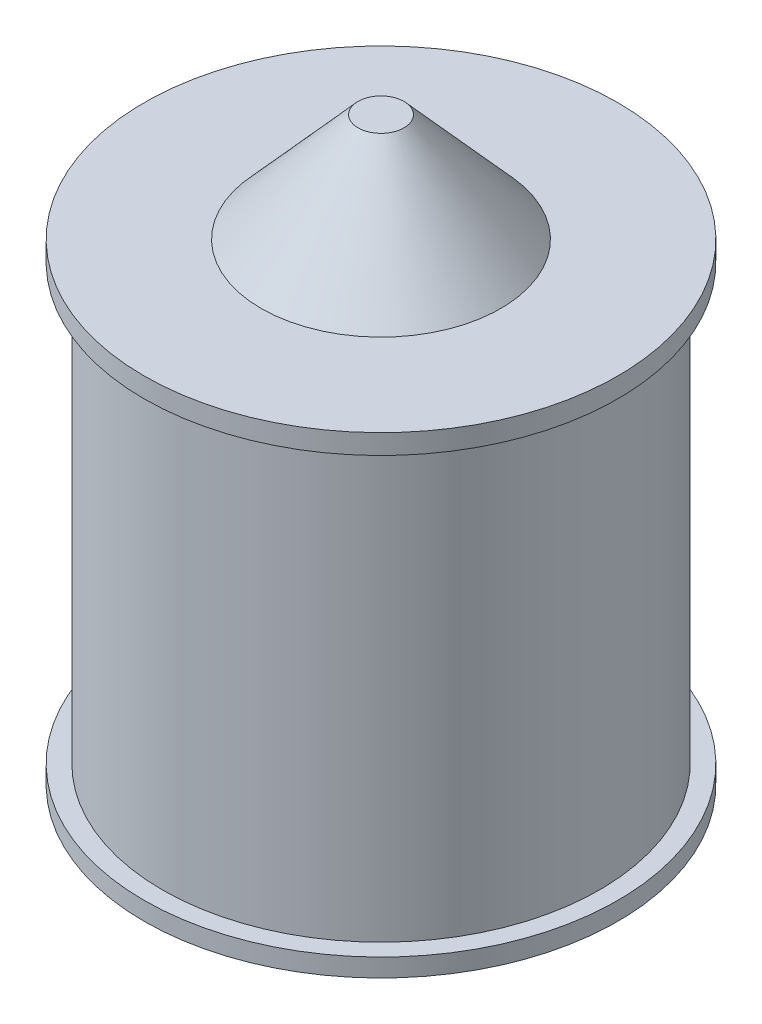
ISO-10303-21;
HEADER;
FILE_DESCRIPTION(('STEP AP214'),'2;1');
FILE_NAME('part.step','',(''),(''),'','','');
FILE_SCHEMA(('AUTOMOTIVE_DESIGN { 1 0 10303 214 1 1 1 1 }'));
ENDSEC;
DATA;
#1=APPLICATION_CONTEXT('core data for automotive mechanical design processes');
#2=APPLICATION_PROTOCOL_DEFINITION('international standard','automotive_design',2000,#1);
#3=PRODUCT_CONTEXT('',#1,'mechanical');
#4=PRODUCT('Part','Part','',(#3));
#5=PRODUCT_RELATED_PRODUCT_CATEGORY('part','',(#4));
#6=PRODUCT_DEFINITION_FORMATION('','',#4);
#7=PRODUCT_DEFINITION_CONTEXT('part definition',#1,'design');
#8=PRODUCT_DEFINITION('design','',#6,#7);
#9=PRODUCT_DEFINITION_SHAPE('','',#8);
#10=(LENGTH_UNIT() NAMED_UNIT(*) SI_UNIT(.MILLI.,.METRE.));
#11=(NAMED_UNIT(*) PLANE_ANGLE_UNIT() SI_UNIT($,.RADIAN.));
#12=(NAMED_UNIT(*) SI_UNIT($,.STERADIAN.) SOLID_ANGLE_UNIT());
#13=UNCERTAINTY_MEASURE_WITH_UNIT(LENGTH_MEASURE(1.E-05),#10,'distance_accuracy_value','');
#14=(GEOMETRIC_REPRESENTATION_CONTEXT(3) GLOBAL_UNCERTAINTY_ASSIGNED_CONTEXT((#13)) GLOBAL_UNIT_ASSIGNED_CONTEXT((#10,
#11,#12)) REPRESENTATION_CONTEXT('',''));
#15=CARTESIAN_POINT('',(0.,0.,0.));
#16=DIRECTION('',(0.,0.,1.));
#17=DIRECTION('',(1.,0.,0.));
#18=AXIS2_PLACEMENT_3D('',#15,#16,#17);
#19=CARTESIAN_POINT('',(50.8214618660544,38.8006335245978,0.));
#20=DIRECTION('',(0.,-1.,0.));
#21=DIRECTION('',(0.,0.,-1.));
#22=AXIS2_PLACEMENT_3D('',#19,#20,#21);
#23=PLANE('',#22);
#24=CARTESIAN_POINT('',(0.,38.8006335245978,0.));
#25=DIRECTION('',(0.,1.,0.));
#26=DIRECTION('',(0.,0.,1.));
#27=AXIS2_PLACEMENT_3D('',#24,#25,#26);
#28=CIRCLE('',#27,50.8214618660544);
#29=CARTESIAN_POINT('',(0.,38.8006335245978,50.8214618660544));
#30=VERTEX_POINT('',#29);
#31=EDGE_CURVE('E117',#30,#30,#28,.T.);
#32=ORIENTED_EDGE('',*,*,#31,.T.);
#33=EDGE_LOOP('',(#32));
#34=FACE_BOUND('',#33,.T.);
#35=CARTESIAN_POINT('',(0.,38.8006335245978,0.));
#36=DIRECTION('',(0.,1.,0.));
#37=DIRECTION('',(0.,0.,1.));
#38=AXIS2_PLACEMENT_3D('',#35,#36,#37);
#39=CIRCLE('',#38,25.7229108897417);
#40=CARTESIAN_POINT('',(0.,38.8006335245978,25.7229108897417));
#41=VERTEX_POINT('',#40);
#42=EDGE_CURVE('E106',#41,#41,#39,.T.);
#43=ORIENTED_EDGE('',*,*,#42,.F.);
#44=EDGE_LOOP('',(#43));
#45=FACE_BOUND('',#44,.T.);
#46=ADVANCED_FACE('F33',(#34,#45),#23,.F.);
#47=CARTESIAN_POINT('',(0.,-62.5731282252533,0.));
#48=DIRECTION('',(0.,1.,0.));
#49=DIRECTION('',(0.,0.,1.));
#50=AXIS2_PLACEMENT_3D('',#47,#48,#49);
#51=PLANE('',#50);
#52=CARTESIAN_POINT('',(0.,-62.5731282252533,0.));
#53=DIRECTION('',(0.,1.,0.));
#54=DIRECTION('',(0.,0.,1.));
#55=AXIS2_PLACEMENT_3D('',#52,#53,#54);
#56=CIRCLE('',#55,50.8214618660544);
#57=CARTESIAN_POINT('',(0.,-62.5731282252533,50.8214618660544));
#58=VERTEX_POINT('',#57);
#59=EDGE_CURVE('E151',#58,#58,#56,.T.);
#60=ORIENTED_EDGE('',*,*,#59,.F.);
#61=EDGE_LOOP('',(#60));
#62=FACE_BOUND('',#61,.T.);
#63=ADVANCED_FACE('F186',(#62),#51,.F.);
#64=CARTESIAN_POINT('',(0.,38.8006335245978,0.));
#65=DIRECTION('',(0.,1.,0.));
#66=DIRECTION('',(0.,0.,1.));
#67=AXIS2_PLACEMENT_3D('',#64,#65,#66);
#68=CYLINDRICAL_SURFACE('',#67,50.8214618660544);
#69=CARTESIAN_POINT('',(0.,-58.6741373887206,0.));
#70=DIRECTION('',(0.,1.,0.));
#71=DIRECTION('',(0.,0.,1.));
#72=AXIS2_PLACEMENT_3D('',#69,#70,#71);
#73=CIRCLE('',#72,50.8214618660544);
#74=CARTESIAN_POINT('',(0.,-58.6741373887206,50.8214618660544));
#75=VERTEX_POINT('',#74);
#76=EDGE_CURVE('E148',#75,#75,#73,.T.);
#77=ORIENTED_EDGE('',*,*,#76,.F.);
#78=EDGE_LOOP('',(#77));
#79=FACE_BOUND('',#78,.T.);
#80=ORIENTED_EDGE('',*,*,#59,.T.);
#81=EDGE_LOOP('',(#80));
#82=FACE_BOUND('',#81,.T.);
#83=ADVANCED_FACE('F192',(#79,#82),#68,.T.);
#84=CARTESIAN_POINT('',(50.8214618660544,-58.6741373887206,0.));
#85=DIRECTION('',(0.,-1.,0.));
#86=DIRECTION('',(0.,0.,-1.));
#87=AXIS2_PLACEMENT_3D('',#84,#85,#86);
#88=PLANE('',#87);
#89=CARTESIAN_POINT('',(0.,-58.6741373887206,0.));
#90=DIRECTION('',(0.,1.,0.));
#91=DIRECTION('',(0.,0.,1.));
#92=AXIS2_PLACEMENT_3D('',#89,#90,#91);
#93=CIRCLE('',#92,46.9224710295217);
#94=CARTESIAN_POINT('',(0.,-58.6741373887206,46.9224710295217));
#95=VERTEX_POINT('',#94);
#96=EDGE_CURVE('E145',#95,#95,#93,.T.);
#97=ORIENTED_EDGE('',*,*,#96,.F.);
#98=EDGE_LOOP('',(#97));
#99=FACE_BOUND('',#98,.T.);
#100=ORIENTED_EDGE('',*,*,#76,.T.);
#101=EDGE_LOOP('',(#100));
#102=FACE_BOUND('',#101,.T.);
#103=ADVANCED_FACE('F245',(#99,#102),#88,.F.);
#104=CARTESIAN_POINT('',(0.,38.8006335245978,0.));
#105=DIRECTION('',(0.,1.,0.));
#106=DIRECTION('',(0.,0.,1.));
#107=AXIS2_PLACEMENT_3D('',#104,#105,#106);
#108=CYLINDRICAL_SURFACE('',#107,46.9224710295217);
#109=CARTESIAN_POINT('',(0.,34.547188975653,0.));
#110=DIRECTION('',(0.,0.999847695156391,-0.0174524064372835));
#111=DIRECTION('',(0.,0.0174524064372835,0.999847695156391));
#112=AXIS2_PLACEMENT_3D('',#109,#110,#111);
#113=ELLIPSE('',#112,46.9296186377489,46.9224710295217);
#114=CARTESIAN_POINT('',(-39.7079121525711,34.1108123524476,-25.));
#115=VERTEX_POINT('',#114);
#116=CARTESIAN_POINT('',(-40.975413337519,34.1481073290499,-22.8633722214324));
#117=VERTEX_POINT('',#116);
#118=EDGE_CURVE('E40',#115,#117,#113,.T.);
#119=ORIENTED_EDGE('',*,*,#118,.T.);
#120=DIRECTION('',(0.,1.,0.));
#121=VECTOR('',#120,1.);
#122=CARTESIAN_POINT('',(-40.975413337519,38.8006335245978,-22.8633722214325));
#123=LINE('',#122,#121);
#124=CARTESIAN_POINT('',(-40.975413337519,-58.2750557421175,-22.8633722214324));
#125=VERTEX_POINT('',#124);
#126=EDGE_CURVE('E11',#117,#125,#123,.F.);
#127=ORIENTED_EDGE('',*,*,#126,.T.);
#128=CARTESIAN_POINT('',(0.,-58.6741373887206,0.));
#129=DIRECTION('',(0.,-0.999847695156391,-0.0174524064372835));
#130=DIRECTION('',(0.,0.0174524064372835,-0.999847695156391));
#131=AXIS2_PLACEMENT_3D('',#128,#129,#130);
#132=ELLIPSE('',#131,46.9296186377489,46.9224710295217);
#133=CARTESIAN_POINT('',(-39.7079121525711,-58.2377607655151,-25.));
#134=VERTEX_POINT('',#133);
#135=EDGE_CURVE('E168',#125,#134,#132,.T.);
#136=ORIENTED_EDGE('',*,*,#135,.T.);
#137=DIRECTION('',(0.,1.,0.));
#138=VECTOR('',#137,1.);
#139=CARTESIAN_POINT('',(-39.7079121525711,38.8006335245978,-25.));
#140=LINE('',#139,#138);
#141=EDGE_CURVE('E166',#115,#134,#140,.F.);
#142=ORIENTED_EDGE('',*,*,#141,.F.);
#143=EDGE_LOOP('',(#119,#127,#136,#142));
#144=FACE_BOUND('',#143,.T.);
#145=CARTESIAN_POINT('',(0.,34.5263314076446,0.));
#146=DIRECTION('',(0.,0.999847695156391,-0.0174524064372835));
#147=DIRECTION('',(0.,0.0174524064372835,0.999847695156391));
#148=AXIS2_PLACEMENT_3D('',#145,#146,#147);
#149=ELLIPSE('',#148,46.9296186377489,46.9224710295217);
#150=CARTESIAN_POINT('',(-44.6487330998803,34.2744644858615,-14.4294462850089));
#151=VERTEX_POINT('',#150);
#152=CARTESIAN_POINT('',(-46.851992422461,34.4814576520084,-2.5708157386236));
#153=VERTEX_POINT('',#152);
#154=EDGE_CURVE('E160',#151,#153,#149,.T.);
#155=ORIENTED_EDGE('',*,*,#154,.T.);
#156=DIRECTION('',(0.,1.,0.));
#157=VECTOR('',#156,1.);
#158=CARTESIAN_POINT('',(-46.851992422461,38.8006335245978,-2.57081573862373));
#159=LINE('',#158,#157);
#160=CARTESIAN_POINT('',(-46.851992422461,-58.6292636330844,-2.5708157386236));
#161=VERTEX_POINT('',#160);
#162=EDGE_CURVE('E163',#153,#161,#159,.F.);
#163=ORIENTED_EDGE('',*,*,#162,.T.);
#164=CARTESIAN_POINT('',(0.,-58.6741373887206,0.));
#165=DIRECTION('',(0.,-0.999847695156391,-0.0174524064372835));
#166=DIRECTION('',(0.,0.0174524064372835,-0.999847695156391));
#167=AXIS2_PLACEMENT_3D('',#164,#165,#166);
#168=ELLIPSE('',#167,46.9296186377489,46.9224710295217);
#169=CARTESIAN_POINT('',(-44.6487330998803,-58.4222704669375,-14.429446285009));
#170=VERTEX_POINT('',#169);
#171=EDGE_CURVE('E154',#161,#170,#168,.T.);
#172=ORIENTED_EDGE('',*,*,#171,.T.);
#173=DIRECTION('',(0.,1.,0.));
#174=VECTOR('',#173,1.);
#175=CARTESIAN_POINT('',(-44.6487330998803,38.8006335245978,-14.4294462850089));
#176=LINE('',#175,#174);
#177=EDGE_CURVE('E157',#170,#151,#176,.T.);
#178=ORIENTED_EDGE('',*,*,#177,.T.);
#179=EDGE_LOOP('',(#155,#163,#172,#178));
#180=FACE_BOUND('',#179,.T.);
#181=CARTESIAN_POINT('',(0.,34.547188975653,0.));
#182=DIRECTION('',(0.,1.,0.));
#183=DIRECTION('',(0.,0.,1.));
#184=AXIS2_PLACEMENT_3D('',#181,#182,#183);
#185=CIRCLE('',#184,46.9224710295217);
#186=CARTESIAN_POINT('',(0.,34.547188975653,46.9224710295217));
#187=VERTEX_POINT('',#186);
#188=EDGE_CURVE('E142',#187,#187,#185,.T.);
#189=ORIENTED_EDGE('',*,*,#188,.F.);
#190=EDGE_LOOP('',(#189));
#191=FACE_BOUND('',#190,.T.);
#192=ORIENTED_EDGE('',*,*,#96,.T.);
#193=EDGE_LOOP('',(#192));
#194=FACE_BOUND('',#193,.T.);
#195=ADVANCED_FACE('F169',(#144,#180,#191,#194),#108,.T.);
#196=CARTESIAN_POINT('',(46.9224710295217,34.547188975653,0.));
#197=DIRECTION('',(0.,1.,0.));
#198=DIRECTION('',(0.,0.,1.));
#199=AXIS2_PLACEMENT_3D('',#196,#197,#198);
#200=PLANE('',#199);
#201=CARTESIAN_POINT('',(0.,34.547188975653,0.));
#202=DIRECTION('',(0.,1.,0.));
#203=DIRECTION('',(0.,0.,1.));
#204=AXIS2_PLACEMENT_3D('',#201,#202,#203);
#205=CIRCLE('',#204,50.8214618660544);
#206=CARTESIAN_POINT('',(0.,34.547188975653,50.8214618660544));
#207=VERTEX_POINT('',#206);
#208=EDGE_CURVE('E139',#207,#207,#205,.T.);
#209=ORIENTED_EDGE('',*,*,#208,.F.);
#210=EDGE_LOOP('',(#209));
#211=FACE_BOUND('',#210,.T.);
#212=ORIENTED_EDGE('',*,*,#188,.T.);
#213=EDGE_LOOP('',(#212));
#214=FACE_BOUND('',#213,.T.);
#215=ADVANCED_FACE('F238',(#211,#214),#200,.F.);
#216=CARTESIAN_POINT('',(0.,38.8006335245978,0.));
#217=DIRECTION('',(0.,1.,0.));
#218=DIRECTION('',(0.,0.,1.));
#219=AXIS2_PLACEMENT_3D('',#216,#217,#218);
#220=CYLINDRICAL_SURFACE('',#219,50.8214618660544);
#221=ORIENTED_EDGE('',*,*,#31,.F.);
#222=EDGE_LOOP('',(#221));
#223=FACE_BOUND('',#222,.T.);
#224=ORIENTED_EDGE('',*,*,#208,.T.);
#225=EDGE_LOOP('',(#224));
#226=FACE_BOUND('',#225,.T.);
#227=ADVANCED_FACE('F227',(#223,#226),#220,.T.);
#228=CARTESIAN_POINT('',(-46.8968661780972,34.5263314076446,0.));
#229=DIRECTION('',(-0.999847695156391,0.,-0.0174524064372835));
#230=DIRECTION('',(-0.0174524064372835,0.,0.999847695156391));
#231=AXIS2_PLACEMENT_3D('',#228,#229,#230);
#232=PLANE('',#231);
#233=ORIENTED_EDGE('',*,*,#162,.F.);
#234=DIRECTION('',(-0.0174497491606827,0.0174497491606827,0.999695459881887));
#235=VECTOR('',#234,1.);
#236=CARTESIAN_POINT('',(-46.8968661780972,34.5263314076446,0.));
#237=LINE('',#236,#235);
#238=CARTESIAN_POINT('',(-46.4604895548918,34.0899547844391,-25.));
#239=VERTEX_POINT('',#238);
#240=EDGE_CURVE('E114',#239,#153,#237,.T.);
#241=ORIENTED_EDGE('',*,*,#240,.F.);
#242=DIRECTION('',(0.,-1.,0.));
#243=VECTOR('',#242,1.);
#244=CARTESIAN_POINT('',(-46.4604895548918,0.,-25.));
#245=LINE('',#244,#243);
#246=CARTESIAN_POINT('',(-46.4604895548918,-58.2377607655151,-25.));
#247=VERTEX_POINT('',#246);
#248=EDGE_CURVE('E101',#239,#247,#245,.T.);
#249=ORIENTED_EDGE('',*,*,#248,.T.);
#250=DIRECTION('',(-0.0174497491606827,-0.0174497491606827,0.999695459881887));
#251=VECTOR('',#250,1.);
#252=CARTESIAN_POINT('',(-46.8684872182458,-58.6457584288692,-1.62582952100727));
#253=LINE('',#252,#251);
#254=EDGE_CURVE('E119',#247,#161,#253,.T.);
#255=ORIENTED_EDGE('',*,*,#254,.T.);
#256=EDGE_LOOP('',(#233,#241,#249,#255));
#257=FACE_BOUND('',#256,.T.);
#258=ADVANCED_FACE('F224',(#257),#232,.T.);
#259=CARTESIAN_POINT('',(-44.3968661780972,34.5263314076446,0.));
#260=DIRECTION('',(0.999847695156391,0.,-0.0174524064372835));
#261=DIRECTION('',(-0.0174524064372835,0.,-0.999847695156391));
#262=AXIS2_PLACEMENT_3D('',#259,#260,#261);
#263=PLANE('',#262);
#264=ORIENTED_EDGE('',*,*,#177,.F.);
#265=DIRECTION('',(0.0174497491606827,-0.0174497491606827,0.999695459881887));
#266=VECTOR('',#265,1.);
#267=CARTESIAN_POINT('',(-44.3976274124616,-58.6733761543562,-0.0436110875300308));
#268=LINE('',#267,#266);
#269=CARTESIAN_POINT('',(-44.8332428013026,-58.2377607655151,-25.));
#270=VERTEX_POINT('',#269);
#271=EDGE_CURVE('E122',#270,#170,#268,.T.);
#272=ORIENTED_EDGE('',*,*,#271,.F.);
#273=DIRECTION('',(0.,1.,0.));
#274=VECTOR('',#273,1.);
#275=CARTESIAN_POINT('',(-44.8332428013026,0.,-25.));
#276=LINE('',#275,#274);
#277=CARTESIAN_POINT('',(-44.8332428013027,34.0899547844391,-25.));
#278=VERTEX_POINT('',#277);
#279=EDGE_CURVE('E132',#270,#278,#276,.T.);
#280=ORIENTED_EDGE('',*,*,#279,.T.);
#281=DIRECTION('',(0.0174497491606827,0.0174497491606827,0.999695459881887));
#282=VECTOR('',#281,1.);
#283=CARTESIAN_POINT('',(-44.3968661780972,34.5263314076446,0.));
#284=LINE('',#283,#282);
#285=EDGE_CURVE('E118',#278,#151,#284,.T.);
#286=ORIENTED_EDGE('',*,*,#285,.T.);
#287=EDGE_LOOP('',(#264,#272,#280,#286));
#288=FACE_BOUND('',#287,.T.);
#289=ADVANCED_FACE('F226',(#288),#263,.T.);
#290=CARTESIAN_POINT('',(-46.8968661780972,34.5263314076446,0.));
#291=DIRECTION('',(0.,0.999847695156391,-0.0174524064372835));
#292=DIRECTION('',(0.,0.0174524064372835,0.999847695156391));
#293=AXIS2_PLACEMENT_3D('',#290,#291,#292);
#294=PLANE('',#293);
#295=ORIENTED_EDGE('',*,*,#154,.F.);
#296=ORIENTED_EDGE('',*,*,#285,.F.);
#297=DIRECTION('',(-1.,0.,0.));
#298=VECTOR('',#297,1.);
#299=CARTESIAN_POINT('',(0.,34.0899547844391,-25.));
#300=LINE('',#299,#298);
#301=EDGE_CURVE('E123',#278,#239,#300,.T.);
#302=ORIENTED_EDGE('',*,*,#301,.T.);
#303=ORIENTED_EDGE('',*,*,#240,.T.);
#304=EDGE_LOOP('',(#295,#296,#302,#303));
#305=FACE_BOUND('',#304,.T.);
#306=ADVANCED_FACE('F219',(#305),#294,.T.);
#307=CARTESIAN_POINT('',(-46.8968661780972,-58.6741373887206,0.));
#308=DIRECTION('',(0.,-0.999847695156391,-0.0174524064372835));
#309=DIRECTION('',(0.,0.0174524064372835,-0.999847695156391));
#310=AXIS2_PLACEMENT_3D('',#307,#308,#309);
#311=PLANE('',#310);
#312=ORIENTED_EDGE('',*,*,#171,.F.);
#313=ORIENTED_EDGE('',*,*,#254,.F.);
#314=DIRECTION('',(1.,0.,0.));
#315=VECTOR('',#314,1.);
#316=CARTESIAN_POINT('',(0.,-58.2377607655151,-25.));
#317=LINE('',#316,#315);
#318=EDGE_CURVE('E129',#247,#270,#317,.T.);
#319=ORIENTED_EDGE('',*,*,#318,.T.);
#320=ORIENTED_EDGE('',*,*,#271,.T.);
#321=EDGE_LOOP('',(#312,#313,#319,#320));
#322=FACE_BOUND('',#321,.T.);
#323=ADVANCED_FACE('F213',(#322),#311,.T.);
#324=CARTESIAN_POINT('',(0.,0.,-25.));
#325=DIRECTION('',(0.,0.,1.));
#326=DIRECTION('',(1.,0.,0.));
#327=AXIS2_PLACEMENT_3D('',#324,#325,#326);
#328=PLANE('',#327);
#329=ORIENTED_EDGE('',*,*,#248,.F.);
#330=ORIENTED_EDGE('',*,*,#301,.F.);
#331=ORIENTED_EDGE('',*,*,#279,.F.);
#332=ORIENTED_EDGE('',*,*,#318,.F.);
#333=EDGE_LOOP('',(#329,#330,#331,#332));
#334=FACE_BOUND('',#333,.T.);
#335=ADVANCED_FACE('F209',(#334),#328,.F.);
#336=CARTESIAN_POINT('',(-41.3744949841221,34.547188975653,0.));
#337=DIRECTION('',(-0.999847695156391,0.,-0.0174524064372835));
#338=DIRECTION('',(-0.0174524064372835,0.,0.999847695156391));
#339=AXIS2_PLACEMENT_3D('',#336,#337,#338);
#340=PLANE('',#339);
#341=ORIENTED_EDGE('',*,*,#126,.F.);
#342=DIRECTION('',(-0.0174497491606827,0.0174497491606827,0.999695459881887));
#343=VECTOR('',#342,1.);
#344=CARTESIAN_POINT('',(-41.3744949841221,34.547188975653,0.));
#345=LINE('',#344,#343);
#346=CARTESIAN_POINT('',(-40.9381183609167,34.1108123524476,-25.));
#347=VERTEX_POINT('',#346);
#348=EDGE_CURVE('E89',#347,#117,#345,.T.);
#349=ORIENTED_EDGE('',*,*,#348,.F.);
#350=DIRECTION('',(0.,-1.,0.));
#351=VECTOR('',#350,1.);
#352=CARTESIAN_POINT('',(-40.9381183609167,0.,-25.));
#353=LINE('',#352,#351);
#354=CARTESIAN_POINT('',(-40.9381183609167,-58.2377607655151,-25.));
#355=VERTEX_POINT('',#354);
#356=EDGE_CURVE('E100',#347,#355,#353,.T.);
#357=ORIENTED_EDGE('',*,*,#356,.T.);
#358=DIRECTION('',(-0.0174497491606827,-0.0174497491606827,0.999695459881887));
#359=VECTOR('',#358,1.);
#360=CARTESIAN_POINT('',(-41.3461096732717,-58.6457520778702,-1.6261933694969));
#361=LINE('',#360,#359);
#362=EDGE_CURVE('E93',#355,#125,#361,.T.);
#363=ORIENTED_EDGE('',*,*,#362,.T.);
#364=EDGE_LOOP('',(#341,#349,#357,#363));
#365=FACE_BOUND('',#364,.T.);
#366=ADVANCED_FACE('F98',(#365),#340,.T.);
#367=CARTESIAN_POINT('',(0.,0.,-25.));
#368=DIRECTION('',(0.,0.,1.));
#369=DIRECTION('',(1.,0.,0.));
#370=AXIS2_PLACEMENT_3D('',#367,#368,#369);
#371=PLANE('',#370);
#372=DIRECTION('',(-1.,0.,0.));
#373=VECTOR('',#372,1.);
#374=CARTESIAN_POINT('',(0.,34.1108123524476,-25.));
#375=LINE('',#374,#373);
#376=EDGE_CURVE('E86',#115,#347,#375,.T.);
#377=ORIENTED_EDGE('',*,*,#376,.F.);
#378=ORIENTED_EDGE('',*,*,#141,.T.);
#379=DIRECTION('',(1.,0.,0.));
#380=VECTOR('',#379,1.);
#381=CARTESIAN_POINT('',(0.,-58.2377607655151,-25.));
#382=LINE('',#381,#380);
#383=EDGE_CURVE('E94',#355,#134,#382,.T.);
#384=ORIENTED_EDGE('',*,*,#383,.F.);
#385=ORIENTED_EDGE('',*,*,#356,.F.);
#386=EDGE_LOOP('',(#377,#378,#384,#385));
#387=FACE_BOUND('',#386,.T.);
#388=ADVANCED_FACE('F104',(#387),#371,.F.);
#389=CARTESIAN_POINT('',(-41.3744949841221,34.547188975653,0.));
#390=DIRECTION('',(0.,0.999847695156391,-0.0174524064372835));
#391=DIRECTION('',(0.,0.0174524064372835,0.999847695156391));
#392=AXIS2_PLACEMENT_3D('',#389,#390,#391);
#393=PLANE('',#392);
#394=ORIENTED_EDGE('',*,*,#118,.F.);
#395=ORIENTED_EDGE('',*,*,#376,.T.);
#396=ORIENTED_EDGE('',*,*,#348,.T.);
#397=EDGE_LOOP('',(#394,#395,#396));
#398=FACE_BOUND('',#397,.T.);
#399=ADVANCED_FACE('F88',(#398),#393,.T.);
#400=CARTESIAN_POINT('',(-41.3744949841221,-58.6741373887206,0.));
#401=DIRECTION('',(0.,-0.999847695156391,-0.0174524064372835));
#402=DIRECTION('',(0.,0.0174524064372835,-0.999847695156391));
#403=AXIS2_PLACEMENT_3D('',#400,#401,#402);
#404=PLANE('',#403);
#405=ORIENTED_EDGE('',*,*,#135,.F.);
#406=ORIENTED_EDGE('',*,*,#362,.F.);
#407=ORIENTED_EDGE('',*,*,#383,.T.);
#408=EDGE_LOOP('',(#405,#406,#407));
#409=FACE_BOUND('',#408,.T.);
#410=ADVANCED_FACE('F172',(#409),#404,.T.);
#411=CARTESIAN_POINT('',(-4.92469546307865,61.9732628137815,0.));
#412=DIRECTION('',(0.,1.,0.));
#413=DIRECTION('',(0.,0.,1.));
#414=AXIS2_PLACEMENT_3D('',#411,#412,#413);
#415=PLANE('',#414);
#416=CARTESIAN_POINT('',(0.,61.9732628137815,0.));
#417=DIRECTION('',(0.,1.,0.));
#418=DIRECTION('',(0.,0.,1.));
#419=AXIS2_PLACEMENT_3D('',#416,#417,#418);
#420=CIRCLE('',#419,4.92469546307865);
#421=CARTESIAN_POINT('',(0.,61.9732628137815,4.92469546307865));
#422=VERTEX_POINT('',#421);
#423=EDGE_CURVE('E110',#422,#422,#420,.T.);
#424=ORIENTED_EDGE('',*,*,#423,.T.);
#425=EDGE_LOOP('',(#424));
#426=FACE_BOUND('',#425,.T.);
#427=ADVANCED_FACE('F174',(#426),#415,.T.);
#428=CARTESIAN_POINT('',(0.,61.9732628137815,0.));
#429=DIRECTION('',(0.,-1.,0.));
#430=DIRECTION('',(0.,0.,-1.));
#431=AXIS2_PLACEMENT_3D('',#428,#429,#430);
#432=CONICAL_SURFACE('',#431,4.92469546307865,0.731450826249272);
#433=ORIENTED_EDGE('',*,*,#42,.T.);
#434=EDGE_LOOP('',(#433));
#435=FACE_BOUND('',#434,.T.);
#436=ORIENTED_EDGE('',*,*,#423,.F.);
#437=EDGE_LOOP('',(#436));
#438=FACE_BOUND('',#437,.T.);
#439=ADVANCED_FACE('F180',(#435,#438),#432,.T.);
#440=CLOSED_SHELL('',(#46,#63,#83,#103,#195,#215,#227,#258,#289,#306,#323,#335,#366,#388,#399,
#410,#427,#439));
#441=MANIFOLD_SOLID_BREP('B2',#440);
#442=ADVANCED_BREP_SHAPE_REPRESENTATION('',(#18,#441),#14);
#443=SHAPE_DEFINITION_REPRESENTATION(#9,#442);
ENDSEC;
END-ISO-10303-21;
